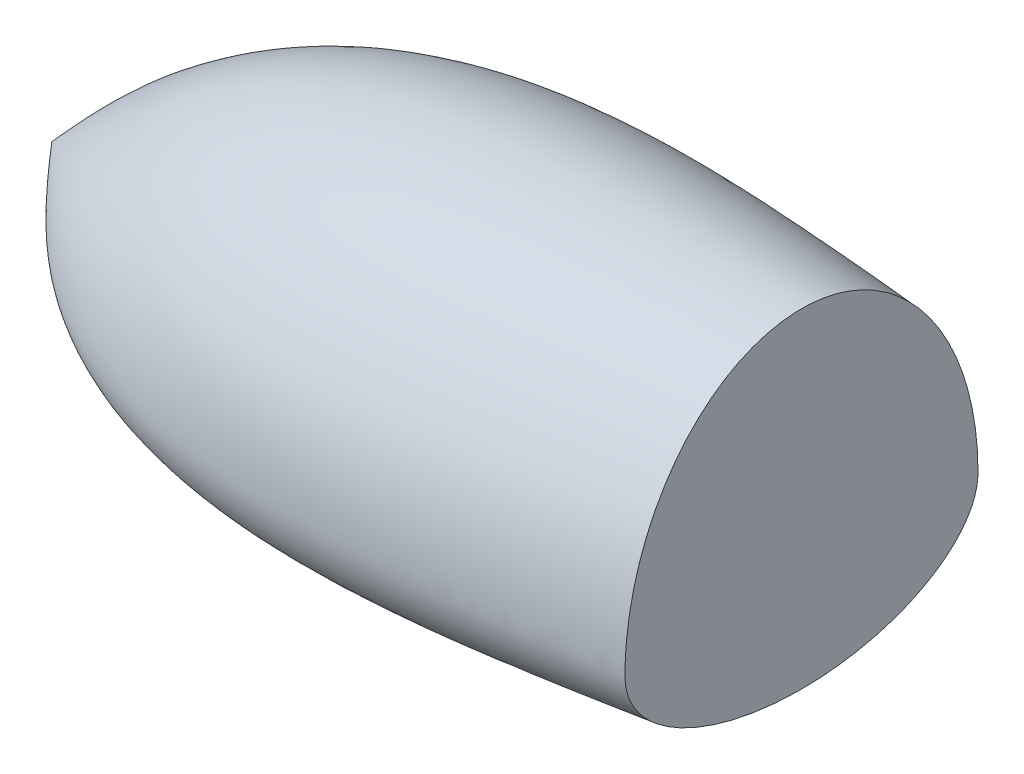
ISO-10303-21;
HEADER;
FILE_DESCRIPTION(('STEP AP214'),'2;1');
FILE_NAME('part.step','',(''),(''),'','','');
FILE_SCHEMA(('AUTOMOTIVE_DESIGN { 1 0 10303 214 1 1 1 1 }'));
ENDSEC;
DATA;
#1=APPLICATION_CONTEXT('core data for automotive mechanical design processes');
#2=APPLICATION_PROTOCOL_DEFINITION('international standard','automotive_design',2000,#1);
#3=PRODUCT_CONTEXT('',#1,'mechanical');
#4=PRODUCT('Part','Part','',(#3));
#5=PRODUCT_RELATED_PRODUCT_CATEGORY('part','',(#4));
#6=PRODUCT_DEFINITION_FORMATION('','',#4);
#7=PRODUCT_DEFINITION_CONTEXT('part definition',#1,'design');
#8=PRODUCT_DEFINITION('design','',#6,#7);
#9=PRODUCT_DEFINITION_SHAPE('','',#8);
#10=(LENGTH_UNIT() NAMED_UNIT(*) SI_UNIT(.MILLI.,.METRE.));
#11=(NAMED_UNIT(*) PLANE_ANGLE_UNIT() SI_UNIT($,.RADIAN.));
#12=(NAMED_UNIT(*) SI_UNIT($,.STERADIAN.) SOLID_ANGLE_UNIT());
#13=UNCERTAINTY_MEASURE_WITH_UNIT(LENGTH_MEASURE(1.E-05),#10,'distance_accuracy_value','');
#14=(GEOMETRIC_REPRESENTATION_CONTEXT(3) GLOBAL_UNCERTAINTY_ASSIGNED_CONTEXT((#13)) GLOBAL_UNIT_ASSIGNED_CONTEXT((#10,
#11,#12)) REPRESENTATION_CONTEXT('',''));
#15=CARTESIAN_POINT('',(0.,0.,0.));
#16=DIRECTION('',(0.,0.,1.));
#17=DIRECTION('',(1.,0.,0.));
#18=AXIS2_PLACEMENT_3D('',#15,#16,#17);
#19=CARTESIAN_POINT('',(884.992854119956,0.,0.));
#20=DIRECTION('',(1.,0.,0.));
#21=DIRECTION('',(0.,0.,-1.));
#22=AXIS2_PLACEMENT_3D('',#19,#20,#21);
#23=PLANE('',#22);
#24=CARTESIAN_POINT('',(884.992854119956,0.,0.));
#25=DIRECTION('',(1.,0.,0.));
#26=DIRECTION('',(0.,0.,-1.));
#27=AXIS2_PLACEMENT_3D('',#24,#25,#26);
#28=ELLIPSE('',#27,184.850982300653,104.053789482559);
#29=CARTESIAN_POINT('',(884.992854119956,0.,184.850982300653));
#30=VERTEX_POINT('',#29);
#31=CARTESIAN_POINT('',(884.992854119956,0.,-184.850982300653));
#32=VERTEX_POINT('',#31);
#33=EDGE_CURVE('E85',#30,#32,#28,.T.);
#34=ORIENTED_EDGE('',*,*,#33,.T.);
#35=CARTESIAN_POINT('',(884.992854119956,0.,0.));
#36=DIRECTION('',(1.,0.,0.));
#37=DIRECTION('',(0.,1.,0.));
#38=AXIS2_PLACEMENT_3D('',#35,#36,#37);
#39=ELLIPSE('',#38,241.046766603634,184.850982300653);
#40=EDGE_CURVE('E12',#32,#30,#39,.T.);
#41=ORIENTED_EDGE('',*,*,#40,.T.);
#42=EDGE_LOOP('',(#34,#41));
#43=FACE_BOUND('',#42,.T.);
#44=ADVANCED_FACE('F71',(#43),#23,.T.);
#45=CARTESIAN_POINT('',(99.9928541197163,0.038116850527465,0.));
#46=CARTESIAN_POINT('',(133.902387351282,0.0243583730093238,-38.6333209326907));
#47=CARTESIAN_POINT('',(329.379691375808,-0.0549547238228284,-261.341707092565));
#48=CARTESIAN_POINT('',(633.570312656007,-0.0246664115652702,-219.46407953294));
#49=CARTESIAN_POINT('',(884.992854119956,0.00036777394774902,-184.850982300653));
#50=CARTESIAN_POINT('',(99.9928541197163,0.038116850527465,0.));
#51=CARTESIAN_POINT('',(133.902387351282,2.62945015212983,-38.6333209326907));
#52=CARTESIAN_POINT('',(329.379691375808,17.5676341774607,-261.341707092565));
#53=CARTESIAN_POINT('',(633.570312656007,15.2970557210646,-219.46407953294));
#54=CARTESIAN_POINT('',(884.992854119956,13.420355500335,-184.850982300653));
#55=CARTESIAN_POINT('',(99.9928541197163,0.038116850527465,0.));
#56=CARTESIAN_POINT('',(133.902387351282,7.79018464338122,-38.0704436530604));
#57=CARTESIAN_POINT('',(329.379691375807,52.4783053088639,-257.534027462887));
#58=CARTESIAN_POINT('',(633.570312656004,45.8997585118987,-216.800889929538));
#59=CARTESIAN_POINT('',(884.992854119951,40.4623950985508,-183.133747539235));
#60=CARTESIAN_POINT('',(99.9928541197163,0.038116850527465,0.));
#61=CARTESIAN_POINT('',(133.902387351282,15.0665831581999,-35.6602751688537));
#62=CARTESIAN_POINT('',(329.379691375809,101.700747579919,-241.23003052872));
#63=CARTESIAN_POINT('',(633.570312656011,90.3031018427115,-205.047337783351));
#64=CARTESIAN_POINT('',(884.992854119962,80.8826106852445,-175.141272537932));
#65=CARTESIAN_POINT('',(99.9928541197163,0.038116850527465,0.));
#66=CARTESIAN_POINT('',(133.902387351282,21.60948292976,-31.8613095225537));
#67=CARTESIAN_POINT('',(329.379691375809,145.96131214837,-215.531277658891));
#68=CARTESIAN_POINT('',(633.570312656005,131.89185004659,-185.888512375086));
#69=CARTESIAN_POINT('',(884.992854119952,120.263023675241,-161.38789052058));
#70=CARTESIAN_POINT('',(99.9928541197163,0.038116850527465,0.));
#71=CARTESIAN_POINT('',(133.902387351282,27.2031738699178,-26.8863977712168));
#72=CARTESIAN_POINT('',(329.379691375807,183.800791229033,-181.877636233799));
#73=CARTESIAN_POINT('',(633.570312656008,169.366035646988,-159.761826805509));
#74=CARTESIAN_POINT('',(884.992854119959,157.435283414803,-141.482456489647));
#75=CARTESIAN_POINT('',(99.9928541197163,0.038116850527465,0.));
#76=CARTESIAN_POINT('',(133.902387351282,30.9390414913346,-21.9565964654188));
#77=CARTESIAN_POINT('',(329.37969137581,209.072706717581,-148.529152133013));
#78=CARTESIAN_POINT('',(633.570312656007,196.027963461066,-132.61139060842));
#79=CARTESIAN_POINT('',(884.992854119954,185.246097509728,-119.454890121695));
#80=CARTESIAN_POINT('',(99.9928541197163,0.038116850527465,0.));
#81=CARTESIAN_POINT('',(133.902387351282,33.3172166360782,-17.6641000258396));
#82=CARTESIAN_POINT('',(329.379691375808,225.160279234974,-119.491825801091));
#83=CARTESIAN_POINT('',(633.570312656008,213.841686126219,-108.009459646503));
#84=CARTESIAN_POINT('',(884.992854119957,204.48653430325,-98.5189445594279));
#85=CARTESIAN_POINT('',(99.9928541197163,0.038116850527465,0.));
#86=CARTESIAN_POINT('',(133.902387351282,34.7874384088258,-14.3007930722203));
#87=CARTESIAN_POINT('',(329.379691375807,235.105845875853,-96.7401606707093));
#88=CARTESIAN_POINT('',(633.570312656007,225.224047830692,-88.2458214190867));
#89=CARTESIAN_POINT('',(884.992854119955,217.056449604647,-81.2249989042049));
#90=CARTESIAN_POINT('',(99.9928541197163,0.038116850527465,0.));
#91=CARTESIAN_POINT('',(133.902387351282,35.9361257600613,-10.8236575192655));
#92=CARTESIAN_POINT('',(329.379691375808,242.876337928828,-73.2184825114676));
#93=CARTESIAN_POINT('',(633.570312656008,234.406255739953,-67.3236147892526));
#94=CARTESIAN_POINT('',(884.992854119957,227.405482404558,-62.451332343214));
#95=CARTESIAN_POINT('',(99.9928541197163,0.038116850527465,0.));
#96=CARTESIAN_POINT('',(133.902387351282,36.7597407585607,-7.26209042900845));
#97=CARTESIAN_POINT('',(329.379691375809,248.447822453026,-49.125652777411));
#98=CARTESIAN_POINT('',(633.570312656008,241.167958123133,-45.4548035155217));
#99=CARTESIAN_POINT('',(884.992854119956,235.150935035336,-42.4207380769784));
#100=CARTESIAN_POINT('',(99.9928541197163,0.038116850527465,0.));
#101=CARTESIAN_POINT('',(133.902387351282,37.2544459452364,-3.64486449020734));
#102=CARTESIAN_POINT('',(329.379691375809,251.79434030011,-24.6563092427767));
#103=CARTESIAN_POINT('',(633.570312656007,245.314911581923,-22.9057748244203));
#104=CARTESIAN_POINT('',(884.992854119955,239.959472190975,-21.4589063755148));
#105=CARTESIAN_POINT('',(99.9928541197163,0.038116850527465,0.));
#106=CARTESIAN_POINT('',(133.902387351282,37.4198063543795,0.));
#107=CARTESIAN_POINT('',(329.379691375808,252.912949070148,1.81512065192487E-13));
#108=CARTESIAN_POINT('',(633.570312656008,246.714193889392,0.));
#109=CARTESIAN_POINT('',(884.992854119958,241.590739474856,-1.83880688453542E-13));
#110=CARTESIAN_POINT('',(99.9928541197163,0.038116850527465,0.));
#111=CARTESIAN_POINT('',(133.902387351282,37.2544459452363,3.64486449020745));
#112=CARTESIAN_POINT('',(329.379691375809,251.79434030011,24.6563092427774));
#113=CARTESIAN_POINT('',(633.570312656006,245.314911581923,22.9057748244202));
#114=CARTESIAN_POINT('',(884.992854119954,239.959472190975,21.458906375514));
#115=CARTESIAN_POINT('',(99.9928541197163,0.038116850527465,0.));
#116=CARTESIAN_POINT('',(133.902387351282,36.7597407585606,7.26209042900861));
#117=CARTESIAN_POINT('',(329.379691375809,248.447822453025,49.125652777412));
#118=CARTESIAN_POINT('',(633.57031265601,241.167958123133,45.454803515522));
#119=CARTESIAN_POINT('',(884.99285411996,235.150935035336,42.4207380769781));
#120=CARTESIAN_POINT('',(99.9928541197163,0.038116850527465,0.));
#121=CARTESIAN_POINT('',(133.902387351282,35.9361257600613,10.8236575192656));
#122=CARTESIAN_POINT('',(329.379691375809,242.876337928828,73.2184825114681));
#123=CARTESIAN_POINT('',(633.570312656005,234.406255739953,67.3236147892524));
#124=CARTESIAN_POINT('',(884.992854119951,227.405482404558,62.4513323432131));
#125=CARTESIAN_POINT('',(99.9928541197163,0.038116850527465,0.));
#126=CARTESIAN_POINT('',(133.902387351282,34.7874384088259,14.3007930722203));
#127=CARTESIAN_POINT('',(329.379691375808,235.105845875853,96.7401606707094));
#128=CARTESIAN_POINT('',(633.57031265601,225.224047830693,88.2458214190869));
#129=CARTESIAN_POINT('',(884.992854119961,217.056449604648,81.224998904205));
#130=CARTESIAN_POINT('',(99.9928541197163,0.038116850527465,0.));
#131=CARTESIAN_POINT('',(133.902387351282,33.3172166360782,17.6641000258397));
#132=CARTESIAN_POINT('',(329.379691375808,225.160279234974,119.491825801092));
#133=CARTESIAN_POINT('',(633.570312656005,213.841686126219,108.009459646503));
#134=CARTESIAN_POINT('',(884.992854119951,204.486534303249,98.5189445594271));
#135=CARTESIAN_POINT('',(99.9928541197163,0.038116850527465,0.));
#136=CARTESIAN_POINT('',(133.902387351282,30.9390414913344,21.956596465419));
#137=CARTESIAN_POINT('',(329.379691375808,209.072706717579,148.529152133014));
#138=CARTESIAN_POINT('',(633.570312656009,196.027963461066,132.611390608421));
#139=CARTESIAN_POINT('',(884.99285411996,185.246097509728,119.454890121696));
#140=CARTESIAN_POINT('',(99.9928541197163,0.038116850527465,0.));
#141=CARTESIAN_POINT('',(133.902387351282,27.2031738699178,26.8863977712165));
#142=CARTESIAN_POINT('',(329.379691375808,183.800791229033,181.877636233797));
#143=CARTESIAN_POINT('',(633.570312656006,169.366035646988,159.761826805508));
#144=CARTESIAN_POINT('',(884.992854119955,157.435283414803,141.482456489646));
#145=CARTESIAN_POINT('',(99.9928541197163,0.038116850527465,0.));
#146=CARTESIAN_POINT('',(133.902387351282,21.60948292976,31.8613095225541));
#147=CARTESIAN_POINT('',(329.379691375808,145.961312148371,215.531277658893));
#148=CARTESIAN_POINT('',(633.570312656007,131.891850046591,185.888512375088));
#149=CARTESIAN_POINT('',(884.992854119956,120.263023675242,161.387890520581));
#150=CARTESIAN_POINT('',(99.9928541197163,0.038116850527465,0.));
#151=CARTESIAN_POINT('',(133.902387351282,15.0665831581999,35.6602751688533));
#152=CARTESIAN_POINT('',(329.379691375808,101.700747579919,241.230030528718));
#153=CARTESIAN_POINT('',(633.570312656007,90.303101842711,205.047337783349));
#154=CARTESIAN_POINT('',(884.992854119955,80.8826106852437,175.141272537931));
#155=CARTESIAN_POINT('',(99.9928541197163,0.038116850527465,0.));
#156=CARTESIAN_POINT('',(133.902387351282,7.79018464338124,38.0704436530607));
#157=CARTESIAN_POINT('',(329.379691375808,52.478305308864,257.534027462889));
#158=CARTESIAN_POINT('',(633.570312656007,45.8997585118993,216.800889929539));
#159=CARTESIAN_POINT('',(884.992854119955,40.4623950985518,183.133747539236));
#160=CARTESIAN_POINT('',(99.9928541197163,0.038116850527465,0.));
#161=CARTESIAN_POINT('',(133.902387351282,2.62945015212984,38.6333209326907));
#162=CARTESIAN_POINT('',(329.379691375808,17.5676341774608,261.341707092565));
#163=CARTESIAN_POINT('',(633.570312656007,15.2970557210646,219.46407953294));
#164=CARTESIAN_POINT('',(884.992854119956,13.420355500335,184.850982300653));
#165=CARTESIAN_POINT('',(99.9928541197163,0.038116850527465,0.));
#166=CARTESIAN_POINT('',(133.902387351282,-0.471589363799221,38.6333209326907));
#167=CARTESIAN_POINT('',(329.379691375808,-3.40987801379981,261.341707092565));
#168=CARTESIAN_POINT('',(633.570312656007,-2.94155919691373,219.46407953294));
#169=CARTESIAN_POINT('',(884.992854119956,-2.55447984955796,184.850982300653));
#170=CARTESIAN_POINT('',(99.9928541197163,0.038116850527465,0.));
#171=CARTESIAN_POINT('',(133.902387351282,-1.46591279403683,38.5870556326749));
#172=CARTESIAN_POINT('',(329.379691375808,-10.1361489215784,261.02873755763));
#173=CARTESIAN_POINT('',(633.570312656008,-8.77322346608126,219.138432983021));
#174=CARTESIAN_POINT('',(884.992854119957,-7.6467252841029,184.51485782307));
#175=CARTESIAN_POINT('',(99.9928541197163,0.038116850527465,0.));
#176=CARTESIAN_POINT('',(133.902387351282,-3.44752295893163,38.3110065672388));
#177=CARTESIAN_POINT('',(329.379691375808,-23.5410898063619,259.161356440484));
#178=CARTESIAN_POINT('',(633.570312656005,-20.2940996819819,217.223349072398));
#179=CARTESIAN_POINT('',(884.992854119953,-17.6103663514003,182.560346143372));
#180=CARTESIAN_POINT('',(99.9928541197163,0.038116850527465,0.));
#181=CARTESIAN_POINT('',(133.902387351282,-5.87919808248903,37.6242417693244));
#182=CARTESIAN_POINT('',(329.379691375808,-39.990572080801,254.515618504293));
#183=CARTESIAN_POINT('',(633.57031265601,-34.1718786025771,212.576120549966));
#184=CARTESIAN_POINT('',(884.99285411996,-29.3625564211834,177.911885607344));
#185=CARTESIAN_POINT('',(99.9928541197163,0.038116850527465,0.));
#186=CARTESIAN_POINT('',(133.902387351282,-8.6399756783536,36.3084192684247));
#187=CARTESIAN_POINT('',(329.379691375808,-58.6663243171466,245.614512145483));
#188=CARTESIAN_POINT('',(633.570312656006,-49.487490589786,204.057202351534));
#189=CARTESIAN_POINT('',(884.992854119954,-41.9009131545723,169.70885722233));
#190=CARTESIAN_POINT('',(99.9928541197163,0.038116850527465,0.));
#191=CARTESIAN_POINT('',(133.902387351282,-11.1912333791936,34.5773327396035));
#192=CARTESIAN_POINT('',(329.379691375809,-75.9247433883993,233.904281245186));
#193=CARTESIAN_POINT('',(633.570312656007,-63.2868099064326,193.279431777652));
#194=CARTESIAN_POINT('',(884.992854119955,-52.841184260527,159.701792675133));
#195=CARTESIAN_POINT('',(99.9928541197163,0.038116850527465,0.));
#196=CARTESIAN_POINT('',(133.902387351282,-13.5090158494717,32.5090898566197));
#197=CARTESIAN_POINT('',(329.379691375808,-91.6037793301205,219.913298521678));
#198=CARTESIAN_POINT('',(633.570312656008,-75.5669538624128,180.797688553602));
#199=CARTESIAN_POINT('',(884.992854119958,-62.3120435067418,148.467480515968));
#200=CARTESIAN_POINT('',(99.9928541197163,0.038116850527465,0.));
#201=CARTESIAN_POINT('',(133.902387351282,-15.5880309216575,30.1708665683001));
#202=CARTESIAN_POINT('',(329.379691375808,-105.667632369905,204.095987170223));
#203=CARTESIAN_POINT('',(633.570312656006,-86.4042343719508,167.029951550502));
#204=CARTESIAN_POINT('',(884.992854119953,-70.4824664308675,136.39377730462));
#205=CARTESIAN_POINT('',(99.9928541197163,0.038116850527465,0.));
#206=CARTESIAN_POINT('',(133.902387351282,-17.4329534060014,27.6184599161353));
#207=CARTESIAN_POINT('',(329.379691375807,-118.147926061248,186.829795821223));
#208=CARTESIAN_POINT('',(633.570312656008,-95.8982936638895,152.285709062185));
#209=CARTESIAN_POINT('',(884.992854119959,-77.5083147078005,123.734000107594));
#210=CARTESIAN_POINT('',(99.9928541197163,0.038116850527465,0.));
#211=CARTESIAN_POINT('',(133.902387351282,-19.0523438376678,24.8939269525139));
#212=CARTESIAN_POINT('',(329.379691375809,-129.102569608419,168.399226598781));
#213=CARTESIAN_POINT('',(633.570312656006,-104.147394899417,136.787022004839));
#214=CARTESIAN_POINT('',(884.992854119954,-83.5212052371306,110.658600336749));
#215=CARTESIAN_POINT('',(99.9928541197163,0.038116850527465,0.));
#216=CARTESIAN_POINT('',(133.902387351282,-20.4564334971079,22.0338626070431));
#217=CARTESIAN_POINT('',(329.379691375808,-138.600774257934,149.051832163232));
#218=CARTESIAN_POINT('',(633.570312656008,-111.241220744121,120.709523929645));
#219=CARTESIAN_POINT('',(884.992854119958,-88.6277409175171,97.2837682733609));
#220=CARTESIAN_POINT('',(99.9928541197163,0.038116850527465,0.));
#221=CARTESIAN_POINT('',(133.902387351282,-21.6540877276882,19.0630574216563));
#222=CARTESIAN_POINT('',(329.379691375808,-146.702511141279,128.955312375531));
#223=CARTESIAN_POINT('',(633.570312656006,-117.252808486837,104.173499013086));
#224=CARTESIAN_POINT('',(884.992854119955,-92.9117586031288,83.6905976289179));
#225=CARTESIAN_POINT('',(99.9928541197163,0.038116850527465,0.));
#226=CARTESIAN_POINT('',(133.902387351282,-22.6542702976938,16.0064337467655));
#227=CARTESIAN_POINT('',(329.379691375808,-153.468417202135,108.278258737629));
#228=CARTESIAN_POINT('',(633.570312656008,-122.246616212891,87.2877423516369));
#229=CARTESIAN_POINT('',(884.992854119957,-96.4408746658288,69.9384600029694));
#230=CARTESIAN_POINT('',(99.9928541197163,0.038116850527465,0.));
#231=CARTESIAN_POINT('',(133.902387351282,-23.7328339844334,11.839361666583));
#232=CARTESIAN_POINT('',(329.379691375809,-160.764545733039,80.0893869367804));
#233=CARTESIAN_POINT('',(633.570312656007,-127.609327132652,64.407553299108));
#234=CARTESIAN_POINT('',(884.992854119955,-100.205558771157,51.4460541858049));
#235=CARTESIAN_POINT('',(99.9928541197163,0.038116850527465,0.));
#236=CARTESIAN_POINT('',(133.902387351282,-24.618521097431,6.50176717680111));
#237=CARTESIAN_POINT('',(329.379691375806,-166.755927692254,43.9823160960981));
#238=CARTESIAN_POINT('',(633.570312656005,-131.98936937868,35.3008897702675));
#239=CARTESIAN_POINT('',(884.992854119954,-103.2537811072,28.1254342575815));
#240=CARTESIAN_POINT('',(99.9928541197163,0.038116850527465,0.));
#241=CARTESIAN_POINT('',(133.902387351282,-24.9697287205197,0.));
#242=CARTESIAN_POINT('',(329.37969137581,-169.131731727372,-2.408051514915E-13));
#243=CARTESIAN_POINT('',(633.57031265601,-133.721346473191,-1.8304713735006E-13));
#244=CARTESIAN_POINT('',(884.99285411996,-104.453616201445,-1.35308431126191E-13));
#245=CARTESIAN_POINT('',(99.9928541197163,0.038116850527465,0.));
#246=CARTESIAN_POINT('',(133.902387351282,-24.618521097431,-6.50176717680113));
#247=CARTESIAN_POINT('',(329.379691375807,-166.755927692254,-43.9823160960983));
#248=CARTESIAN_POINT('',(633.570312656004,-131.98936937868,-35.3008897702677));
#249=CARTESIAN_POINT('',(884.992854119952,-103.2537811072,-28.1254342575817));
#250=CARTESIAN_POINT('',(99.9928541197163,0.038116850527465,0.));
#251=CARTESIAN_POINT('',(133.902387351282,-23.7328339844334,-11.8393616665831));
#252=CARTESIAN_POINT('',(329.379691375807,-160.764545733039,-80.089386936781));
#253=CARTESIAN_POINT('',(633.570312656008,-127.609327132653,-64.4075532991086));
#254=CARTESIAN_POINT('',(884.992854119958,-100.205558771157,-51.4460541858054));
#255=CARTESIAN_POINT('',(99.9928541197163,0.038116850527465,0.));
#256=CARTESIAN_POINT('',(133.902387351282,-22.6542702976938,-16.0064337467655));
#257=CARTESIAN_POINT('',(329.379691375809,-153.468417202135,-108.278258737629));
#258=CARTESIAN_POINT('',(633.570312656006,-122.246616212891,-87.2877423516371));
#259=CARTESIAN_POINT('',(884.992854119954,-96.4408746658285,-69.9384600029697));
#260=CARTESIAN_POINT('',(99.9928541197163,0.038116850527465,0.));
#261=CARTESIAN_POINT('',(133.902387351282,-21.6540877276881,-19.0630574216564));
#262=CARTESIAN_POINT('',(329.379691375809,-146.702511141279,-128.955312375531));
#263=CARTESIAN_POINT('',(633.570312656007,-117.252808486837,-104.173499013086));
#264=CARTESIAN_POINT('',(884.992854119955,-92.9117586031288,-83.6905976289183));
#265=CARTESIAN_POINT('',(99.9928541197163,0.038116850527465,0.));
#266=CARTESIAN_POINT('',(133.902387351282,-20.4564334971078,-22.0338626070431));
#267=CARTESIAN_POINT('',(329.379691375808,-138.600774257933,-149.051832163232));
#268=CARTESIAN_POINT('',(633.570312656009,-111.241220744121,-120.709523929645));
#269=CARTESIAN_POINT('',(884.992854119959,-88.6277409175171,-97.2837682733613));
#270=CARTESIAN_POINT('',(99.9928541197163,0.038116850527465,0.));
#271=CARTESIAN_POINT('',(133.902387351282,-19.0523438376678,-24.893926952514));
#272=CARTESIAN_POINT('',(329.379691375808,-129.102569608419,-168.399226598781));
#273=CARTESIAN_POINT('',(633.570312656006,-104.147394899417,-136.787022004839));
#274=CARTESIAN_POINT('',(884.992854119953,-83.5212052371302,-110.658600336749));
#275=CARTESIAN_POINT('',(99.9928541197163,0.038116850527465,0.));
#276=CARTESIAN_POINT('',(133.902387351282,-17.4329534060013,-27.6184599161354));
#277=CARTESIAN_POINT('',(329.379691375809,-118.147926061248,-186.829795821223));
#278=CARTESIAN_POINT('',(633.570312656008,-95.8982936638894,-152.285709062186));
#279=CARTESIAN_POINT('',(884.992854119957,-77.5083147078006,-123.734000107595));
#280=CARTESIAN_POINT('',(99.9928541197163,0.038116850527465,0.));
#281=CARTESIAN_POINT('',(133.902387351282,-15.5880309216575,-30.1708665683));
#282=CARTESIAN_POINT('',(329.379691375808,-105.667632369905,-204.095987170222));
#283=CARTESIAN_POINT('',(633.570312656007,-86.4042343719507,-167.029951550502));
#284=CARTESIAN_POINT('',(884.992854119955,-70.4824664308672,-136.39377730462));
#285=CARTESIAN_POINT('',(99.9928541197163,0.038116850527465,0.));
#286=CARTESIAN_POINT('',(133.902387351282,-13.5090158494717,-32.5090898566199));
#287=CARTESIAN_POINT('',(329.379691375809,-91.6037793301203,-219.913298521679));
#288=CARTESIAN_POINT('',(633.570312656008,-75.5669538624126,-180.797688553603));
#289=CARTESIAN_POINT('',(884.992854119956,-62.3120435067417,-148.467480515969));
#290=CARTESIAN_POINT('',(99.9928541197163,0.038116850527465,0.));
#291=CARTESIAN_POINT('',(133.902387351282,-11.1912333791936,-34.5773327396033));
#292=CARTESIAN_POINT('',(329.379691375806,-75.9247433883991,-233.904281245185));
#293=CARTESIAN_POINT('',(633.570312656007,-63.2868099064325,-193.279431777652));
#294=CARTESIAN_POINT('',(884.992854119957,-52.841184260527,-159.701792675133));
#295=CARTESIAN_POINT('',(99.9928541197163,0.038116850527465,0.));
#296=CARTESIAN_POINT('',(133.902387351282,-8.63997567835353,-36.3084192684249));
#297=CARTESIAN_POINT('',(329.37969137581,-58.6663243171461,-245.614512145484));
#298=CARTESIAN_POINT('',(633.570312656006,-49.4874905897858,-204.057202351535));
#299=CARTESIAN_POINT('',(884.992854119953,-41.9009131545722,-169.708857222331));
#300=CARTESIAN_POINT('',(99.9928541197163,0.038116850527465,0.));
#301=CARTESIAN_POINT('',(133.902387351282,-5.87919808248897,-37.6242417693244));
#302=CARTESIAN_POINT('',(329.379691375807,-39.9905720808006,-254.515618504293));
#303=CARTESIAN_POINT('',(633.570312656009,-34.1718786025771,-212.576120549966));
#304=CARTESIAN_POINT('',(884.99285411996,-29.3625564211837,-177.911885607344));
#305=CARTESIAN_POINT('',(99.9928541197163,0.038116850527465,0.));
#306=CARTESIAN_POINT('',(133.902387351282,-3.4475229589316,-38.3110065672389));
#307=CARTESIAN_POINT('',(329.379691375809,-23.5410898063617,-259.161356440484));
#308=CARTESIAN_POINT('',(633.570312656006,-20.2940996819816,-217.223349072399));
#309=CARTESIAN_POINT('',(884.992854119953,-17.6103663514,-182.560346143372));
#310=CARTESIAN_POINT('',(99.9928541197163,0.038116850527465,0.));
#311=CARTESIAN_POINT('',(133.902387351282,-1.46591279403683,-38.5870556326749));
#312=CARTESIAN_POINT('',(329.379691375808,-10.1361489215784,-261.028737557631));
#313=CARTESIAN_POINT('',(633.570312656008,-8.77322346608132,-219.138432983021));
#314=CARTESIAN_POINT('',(884.992854119958,-7.64672528410306,-184.51485782307));
#315=CARTESIAN_POINT('',(99.9928541197163,0.038116850527465,0.));
#316=CARTESIAN_POINT('',(133.902387351282,-0.47158936379922,-38.6333209326907));
#317=CARTESIAN_POINT('',(329.379691375808,-3.4098780137998,-261.341707092565));
#318=CARTESIAN_POINT('',(633.570312656007,-2.94155919691371,-219.46407953294));
#319=CARTESIAN_POINT('',(884.992854119956,-2.55447984955792,-184.850982300653));
#320=CARTESIAN_POINT('',(99.9928541197163,0.038116850527465,0.));
#321=CARTESIAN_POINT('',(133.902387351282,0.0243583730093238,-38.6333209326907));
#322=CARTESIAN_POINT('',(329.379691375808,-0.0549547238228284,-261.341707092565));
#323=CARTESIAN_POINT('',(633.570312656007,-0.0246664115652702,-219.46407953294));
#324=CARTESIAN_POINT('',(884.992854119956,0.00036777394774902,-184.850982300653));
#325=B_SPLINE_SURFACE_WITH_KNOTS('',3,3,((#45,#46,#47,#48,#49),(#50,#51,#52,#53,#54),(#55,#56,
#57,#58,#59),(#60,#61,#62,#63,#64),(#65,#66,#67,#68,#69),(#70,#71,#72,#73,#74),(#75,#76,#77,#78,
#79),(#80,#81,#82,#83,#84),(#85,#86,#87,#88,#89),(#90,#91,#92,#93,#94),(#95,#96,#97,#98,#99),
(#100,#101,#102,#103,#104),(#105,#106,#107,#108,#109),(#110,#111,#112,#113,#114),(#115,#116,
#117,#118,#119),(#120,#121,#122,#123,#124),(#125,#126,#127,#128,#129),(#130,#131,#132,#133,
#134),(#135,#136,#137,#138,#139),(#140,#141,#142,#143,#144),(#145,#146,#147,#148,#149),(#150,
#151,#152,#153,#154),(#155,#156,#157,#158,#159),(#160,#161,#162,#163,#164),(#165,#166,#167,#168,
#169),(#170,#171,#172,#173,#174),(#175,#176,#177,#178,#179),(#180,#181,#182,#183,#184),(#185,
#186,#187,#188,#189),(#190,#191,#192,#193,#194),(#195,#196,#197,#198,#199),(#200,#201,#202,#203,
#204),(#205,#206,#207,#208,#209),(#210,#211,#212,#213,#214),(#215,#216,#217,#218,#219),(#220,
#221,#222,#223,#224),(#225,#226,#227,#228,#229),(#230,#231,#232,#233,#234),(#235,#236,#237,#238,
#239),(#240,#241,#242,#243,#244),(#245,#246,#247,#248,#249),(#250,#251,#252,#253,#254),(#255,
#256,#257,#258,#259),(#260,#261,#262,#263,#264),(#265,#266,#267,#268,#269),(#270,#271,#272,#273,
#274),(#275,#276,#277,#278,#279),(#280,#281,#282,#283,#284),(#285,#286,#287,#288,#289),(#290,
#291,#292,#293,#294),(#295,#296,#297,#298,#299),(#300,#301,#302,#303,#304),(#305,#306,#307,#308,
#309),(#310,#311,#312,#313,#314),(#315,#316,#317,#318,#319),(#320,#321,#322,#323,#324)),
.UNSPECIFIED.,.T.,.F.,.F.,(4,1,1,1,1,1,1,1,1,1,1,1,1,1,1,1,1,1,1,1,1,1,2,1,1,1,1,1,1,1,1,1,1,1,
1,1,1,1,1,1,1,1,1,1,1,1,1,1,1,1,1,1,4),(4,1,4),(0.,0.035481019216277,0.0709620384325539,
0.106443057648831,0.141924076865108,0.177405096081385,0.195145605689523,0.212886115297662,
0.2306266249058,0.248367134513939,0.266107644122077,0.283848153730216,0.301588663338354,
0.319329172946493,0.337069682554631,0.35481019216277,0.372550701770908,0.390291211379047,
0.425772230595324,0.4612532498116,0.496734269027878,0.532215288244155,0.567696307460432,
0.574451052656362,0.581205797852293,0.594715288244155,0.608224778636016,0.621734269027878,
0.635243759419739,0.648753249811601,0.662262740203462,0.675772230595324,0.689281720987185,
0.702791211379047,0.716300701770908,0.72981019216277,0.756829172946493,0.783848153730216,
0.810867134513939,0.837886115297662,0.851395605689523,0.864905096081385,0.878414586473246,
0.891924076865108,0.90543356725697,0.918943057648831,0.932452548040692,0.945962038432554,
0.959471528824415,0.972981019216277,0.986490509608138,0.993245254804069,1.),(0.,
0.173470436380232,1.),.UNSPECIFIED.);
#326=CARTESIAN_POINT('',(99.9928541197163,0.038116850527465,0.));
#327=VERTEX_POINT('',#326);
#328=VERTEX_LOOP('',#327);
#329=FACE_BOUND('',#328,.T.);
#330=ORIENTED_EDGE('',*,*,#33,.F.);
#331=ORIENTED_EDGE('',*,*,#40,.F.);
#332=EDGE_LOOP('',(#330,#331));
#333=FACE_BOUND('',#332,.T.);
#334=ADVANCED_FACE('F73',(#329,#333),#325,.T.);
#335=CLOSED_SHELL('',(#44,#334));
#336=MANIFOLD_SOLID_BREP('B2',#335);
#337=ADVANCED_BREP_SHAPE_REPRESENTATION('',(#18,#336),#14);
#338=SHAPE_DEFINITION_REPRESENTATION(#9,#337);
ENDSEC;
END-ISO-10303-21;
